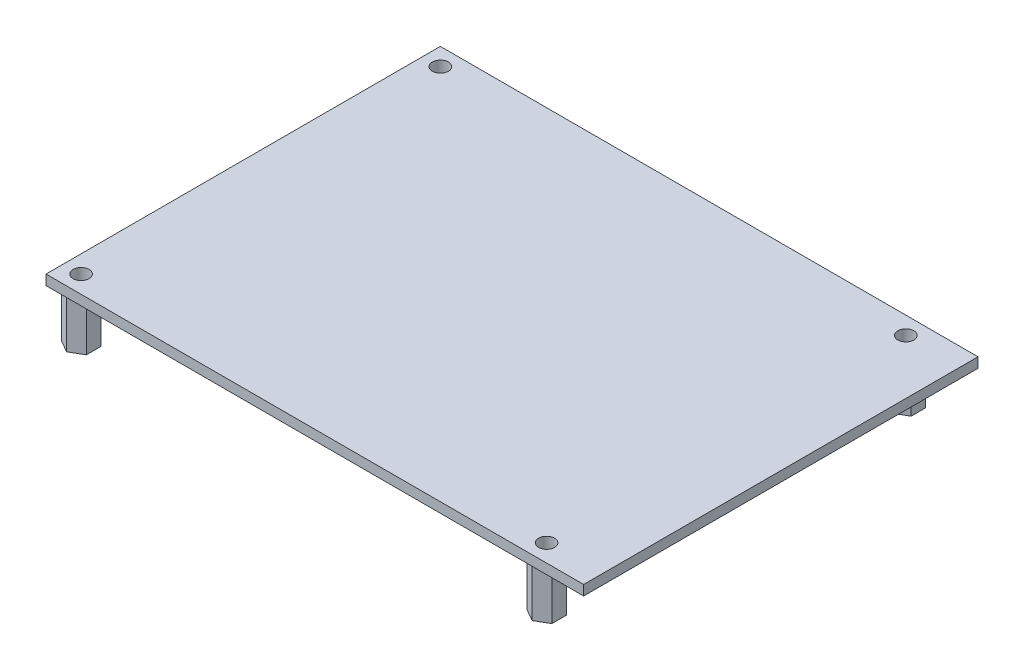
ISO-10303-21;
HEADER;
FILE_DESCRIPTION(('STEP AP214'),'2;1');
FILE_NAME('part.step','',(''),(''),'','','');
FILE_SCHEMA(('AUTOMOTIVE_DESIGN { 1 0 10303 214 1 1 1 1 }'));
ENDSEC;
DATA;
#1=APPLICATION_CONTEXT('core data for automotive mechanical design processes');
#2=APPLICATION_PROTOCOL_DEFINITION('international standard','automotive_design',2000,#1);
#3=PRODUCT_CONTEXT('',#1,'mechanical');
#4=PRODUCT('Part','Part','',(#3));
#5=PRODUCT_RELATED_PRODUCT_CATEGORY('part','',(#4));
#6=PRODUCT_DEFINITION_FORMATION('','',#4);
#7=PRODUCT_DEFINITION_CONTEXT('part definition',#1,'design');
#8=PRODUCT_DEFINITION('design','',#6,#7);
#9=PRODUCT_DEFINITION_SHAPE('','',#8);
#10=(LENGTH_UNIT() NAMED_UNIT(*) SI_UNIT(.MILLI.,.METRE.));
#11=(NAMED_UNIT(*) PLANE_ANGLE_UNIT() SI_UNIT($,.RADIAN.));
#12=(NAMED_UNIT(*) SI_UNIT($,.STERADIAN.) SOLID_ANGLE_UNIT());
#13=UNCERTAINTY_MEASURE_WITH_UNIT(LENGTH_MEASURE(1.E-05),#10,'distance_accuracy_value','');
#14=(GEOMETRIC_REPRESENTATION_CONTEXT(3) GLOBAL_UNCERTAINTY_ASSIGNED_CONTEXT((#13)) GLOBAL_UNIT_ASSIGNED_CONTEXT((#10,
#11,#12)) REPRESENTATION_CONTEXT('',''));
#15=CARTESIAN_POINT('',(0.,0.,0.));
#16=DIRECTION('',(0.,0.,1.));
#17=DIRECTION('',(1.,0.,0.));
#18=AXIS2_PLACEMENT_3D('',#15,#16,#17);
#19=CARTESIAN_POINT('',(0.,0.,0.));
#20=DIRECTION('',(0.,-1.,0.));
#21=DIRECTION('',(0.,0.,-1.));
#22=AXIS2_PLACEMENT_3D('',#19,#20,#21);
#23=PLANE('',#22);
#24=DIRECTION('',(0.866025403784439,0.,0.5));
#25=VECTOR('',#24,1.);
#26=CARTESIAN_POINT('',(3.49999999999999,0.,-6.38675134594813));
#27=LINE('',#26,#25);
#28=CARTESIAN_POINT('',(3.49999999999999,0.,-6.38675134594813));
#29=VERTEX_POINT('',#28);
#30=CARTESIAN_POINT('',(5.99999999999999,0.,-4.94337567297407));
#31=VERTEX_POINT('',#30);
#32=EDGE_CURVE('E246',#29,#31,#27,.T.);
#33=ORIENTED_EDGE('',*,*,#32,.F.);
#34=DIRECTION('',(0.866025403784439,0.,-0.5));
#35=VECTOR('',#34,1.);
#36=CARTESIAN_POINT('',(0.999999999999992,0.,-4.94337567297407));
#37=LINE('',#36,#35);
#38=CARTESIAN_POINT('',(0.999999999999992,0.,-4.94337567297407));
#39=VERTEX_POINT('',#38);
#40=EDGE_CURVE('E243',#39,#29,#37,.T.);
#41=ORIENTED_EDGE('',*,*,#40,.F.);
#42=DIRECTION('',(0.,0.,-1.));
#43=VECTOR('',#42,1.);
#44=CARTESIAN_POINT('',(0.999999999999993,0.,-2.05662432702594));
#45=LINE('',#44,#43);
#46=CARTESIAN_POINT('',(0.999999999999993,0.,-2.05662432702594));
#47=VERTEX_POINT('',#46);
#48=EDGE_CURVE('E256',#47,#39,#45,.T.);
#49=ORIENTED_EDGE('',*,*,#48,.F.);
#50=DIRECTION('',(-0.866025403784439,0.,-0.5));
#51=VECTOR('',#50,1.);
#52=CARTESIAN_POINT('',(3.49999999999999,0.,-0.613248654051876));
#53=LINE('',#52,#51);
#54=CARTESIAN_POINT('',(3.49999999999999,0.,-0.613248654051876));
#55=VERTEX_POINT('',#54);
#56=EDGE_CURVE('E272',#55,#47,#53,.T.);
#57=ORIENTED_EDGE('',*,*,#56,.F.);
#58=DIRECTION('',(-0.866025403784439,0.,0.5));
#59=VECTOR('',#58,1.);
#60=CARTESIAN_POINT('',(5.99999999999999,0.,-2.05662432702594));
#61=LINE('',#60,#59);
#62=CARTESIAN_POINT('',(5.99999999999999,0.,-2.05662432702594));
#63=VERTEX_POINT('',#62);
#64=EDGE_CURVE('E270',#63,#55,#61,.T.);
#65=ORIENTED_EDGE('',*,*,#64,.F.);
#66=DIRECTION('',(0.,0.,1.));
#67=VECTOR('',#66,1.);
#68=CARTESIAN_POINT('',(5.99999999999999,0.,-4.94337567297407));
#69=LINE('',#68,#67);
#70=EDGE_CURVE('E268',#31,#63,#69,.T.);
#71=ORIENTED_EDGE('',*,*,#70,.F.);
#72=EDGE_LOOP('',(#33,#41,#49,#57,#65,#71));
#73=FACE_BOUND('',#72,.T.);
#74=DIRECTION('',(0.866025403784439,0.,-0.5));
#75=VECTOR('',#74,1.);
#76=CARTESIAN_POINT('',(93.9,0.,-4.94337567297404));
#77=LINE('',#76,#75);
#78=CARTESIAN_POINT('',(93.9,0.,-4.94337567297404));
#79=VERTEX_POINT('',#78);
#80=CARTESIAN_POINT('',(96.4,0.,-6.3867513459481));
#81=VERTEX_POINT('',#80);
#82=EDGE_CURVE('E350',#79,#81,#77,.T.);
#83=ORIENTED_EDGE('',*,*,#82,.F.);
#84=DIRECTION('',(0.,0.,-1.));
#85=VECTOR('',#84,1.);
#86=CARTESIAN_POINT('',(93.9,0.,-2.05662432702593));
#87=LINE('',#86,#85);
#88=CARTESIAN_POINT('',(93.9,0.,-2.05662432702593));
#89=VERTEX_POINT('',#88);
#90=EDGE_CURVE('E332',#89,#79,#87,.T.);
#91=ORIENTED_EDGE('',*,*,#90,.F.);
#92=DIRECTION('',(-0.866025403784438,0.,-0.5));
#93=VECTOR('',#92,1.);
#94=CARTESIAN_POINT('',(96.4,0.,-0.613248654051875));
#95=LINE('',#94,#93);
#96=CARTESIAN_POINT('',(96.4,0.,-0.613248654051865));
#97=VERTEX_POINT('',#96);
#98=EDGE_CURVE('E337',#97,#89,#95,.T.);
#99=ORIENTED_EDGE('',*,*,#98,.F.);
#100=DIRECTION('',(-0.866025403784439,0.,0.499999999999999));
#101=VECTOR('',#100,1.);
#102=CARTESIAN_POINT('',(98.9,0.,-2.05662432702594));
#103=LINE('',#102,#101);
#104=CARTESIAN_POINT('',(98.9,0.,-2.05662432702594));
#105=VERTEX_POINT('',#104);
#106=EDGE_CURVE('E356',#105,#97,#103,.T.);
#107=ORIENTED_EDGE('',*,*,#106,.F.);
#108=DIRECTION('',(0.,0.,1.));
#109=VECTOR('',#108,1.);
#110=CARTESIAN_POINT('',(98.9,0.,-4.94337567297405));
#111=LINE('',#110,#109);
#112=CARTESIAN_POINT('',(98.9,0.,-4.94337567297405));
#113=VERTEX_POINT('',#112);
#114=EDGE_CURVE('E354',#113,#105,#111,.T.);
#115=ORIENTED_EDGE('',*,*,#114,.F.);
#116=DIRECTION('',(0.866025403784439,0.,0.5));
#117=VECTOR('',#116,1.);
#118=CARTESIAN_POINT('',(96.4,0.,-6.3867513459481));
#119=LINE('',#118,#117);
#120=EDGE_CURVE('E352',#81,#113,#119,.T.);
#121=ORIENTED_EDGE('',*,*,#120,.F.);
#122=EDGE_LOOP('',(#83,#91,#99,#107,#115,#121));
#123=FACE_BOUND('',#122,.T.);
#124=DIRECTION('',(0.,0.,1.));
#125=VECTOR('',#124,1.);
#126=CARTESIAN_POINT('',(0.,0.,0.));
#127=LINE('',#126,#125);
#128=CARTESIAN_POINT('',(0.,0.,-78.7));
#129=VERTEX_POINT('',#128);
#130=CARTESIAN_POINT('',(0.,0.,0.));
#131=VERTEX_POINT('',#130);
#132=EDGE_CURVE('E387',#129,#131,#127,.T.);
#133=ORIENTED_EDGE('',*,*,#132,.F.);
#134=DIRECTION('',(-1.,0.,0.));
#135=VECTOR('',#134,1.);
#136=CARTESIAN_POINT('',(0.,0.,-78.7));
#137=LINE('',#136,#135);
#138=CARTESIAN_POINT('',(107.3,0.,-78.7));
#139=VERTEX_POINT('',#138);
#140=EDGE_CURVE('E392',#139,#129,#137,.T.);
#141=ORIENTED_EDGE('',*,*,#140,.F.);
#142=DIRECTION('',(0.,0.,-1.));
#143=VECTOR('',#142,1.);
#144=CARTESIAN_POINT('',(107.3,0.,0.));
#145=LINE('',#144,#143);
#146=CARTESIAN_POINT('',(107.3,0.,0.));
#147=VERTEX_POINT('',#146);
#148=EDGE_CURVE('E403',#147,#139,#145,.T.);
#149=ORIENTED_EDGE('',*,*,#148,.F.);
#150=DIRECTION('',(1.,0.,0.));
#151=VECTOR('',#150,1.);
#152=CARTESIAN_POINT('',(0.,0.,0.));
#153=LINE('',#152,#151);
#154=EDGE_CURVE('E401',#131,#147,#153,.T.);
#155=ORIENTED_EDGE('',*,*,#154,.F.);
#156=EDGE_LOOP('',(#133,#141,#149,#155));
#157=FACE_BOUND('',#156,.T.);
#158=DIRECTION('',(0.866025403784439,0.,-0.499999999999999));
#159=VECTOR('',#158,1.);
#160=CARTESIAN_POINT('',(93.9,0.,-76.6433756729741));
#161=LINE('',#160,#159);
#162=CARTESIAN_POINT('',(93.9,0.,-76.6433756729741));
#163=VERTEX_POINT('',#162);
#164=CARTESIAN_POINT('',(96.4,0.,-78.0867513459481));
#165=VERTEX_POINT('',#164);
#166=EDGE_CURVE('E307',#163,#165,#161,.T.);
#167=ORIENTED_EDGE('',*,*,#166,.F.);
#168=DIRECTION('',(0.,0.,-1.));
#169=VECTOR('',#168,1.);
#170=CARTESIAN_POINT('',(93.9,0.,-73.756624327026));
#171=LINE('',#170,#169);
#172=CARTESIAN_POINT('',(93.9,0.,-73.756624327026));
#173=VERTEX_POINT('',#172);
#174=EDGE_CURVE('E289',#173,#163,#171,.T.);
#175=ORIENTED_EDGE('',*,*,#174,.F.);
#176=DIRECTION('',(-0.866025403784437,0.,-0.500000000000003));
#177=VECTOR('',#176,1.);
#178=CARTESIAN_POINT('',(96.4,0.,-72.3132486540519));
#179=LINE('',#178,#177);
#180=CARTESIAN_POINT('',(96.4,0.,-72.3132486540519));
#181=VERTEX_POINT('',#180);
#182=EDGE_CURVE('E294',#181,#173,#179,.T.);
#183=ORIENTED_EDGE('',*,*,#182,.F.);
#184=DIRECTION('',(-0.866025403784441,0.,0.499999999999995));
#185=VECTOR('',#184,1.);
#186=CARTESIAN_POINT('',(98.9,0.,-73.7566243270259));
#187=LINE('',#186,#185);
#188=CARTESIAN_POINT('',(98.9,0.,-73.7566243270259));
#189=VERTEX_POINT('',#188);
#190=EDGE_CURVE('E313',#189,#181,#187,.T.);
#191=ORIENTED_EDGE('',*,*,#190,.F.);
#192=DIRECTION('',(0.,0.,1.));
#193=VECTOR('',#192,1.);
#194=CARTESIAN_POINT('',(98.9,0.,-76.6433756729741));
#195=LINE('',#194,#193);
#196=CARTESIAN_POINT('',(98.9,0.,-76.6433756729741));
#197=VERTEX_POINT('',#196);
#198=EDGE_CURVE('E311',#197,#189,#195,.T.);
#199=ORIENTED_EDGE('',*,*,#198,.F.);
#200=DIRECTION('',(0.866025403784441,0.,0.499999999999995));
#201=VECTOR('',#200,1.);
#202=CARTESIAN_POINT('',(96.4,0.,-78.0867513459481));
#203=LINE('',#202,#201);
#204=EDGE_CURVE('E309',#165,#197,#203,.T.);
#205=ORIENTED_EDGE('',*,*,#204,.F.);
#206=EDGE_LOOP('',(#167,#175,#183,#191,#199,#205));
#207=FACE_BOUND('',#206,.T.);
#208=DIRECTION('',(-0.866025403784438,0.,-0.500000000000001));
#209=VECTOR('',#208,1.);
#210=CARTESIAN_POINT('',(3.49999999999999,0.,-72.3132486540519));
#211=LINE('',#210,#209);
#212=CARTESIAN_POINT('',(3.49999999999999,0.,-72.3132486540519));
#213=VERTEX_POINT('',#212);
#214=CARTESIAN_POINT('',(0.999999999999984,0.,-73.7566243270259));
#215=VERTEX_POINT('',#214);
#216=EDGE_CURVE('E599',#213,#215,#211,.T.);
#217=ORIENTED_EDGE('',*,*,#216,.F.);
#218=DIRECTION('',(-0.866025403784438,0.,0.500000000000001));
#219=VECTOR('',#218,1.);
#220=CARTESIAN_POINT('',(5.99999999999998,0.,-73.7566243270259));
#221=LINE('',#220,#219);
#222=CARTESIAN_POINT('',(5.99999999999998,0.,-73.7566243270259));
#223=VERTEX_POINT('',#222);
#224=EDGE_CURVE('E241',#223,#213,#221,.T.);
#225=ORIENTED_EDGE('',*,*,#224,.F.);
#226=DIRECTION('',(0.,0.,1.));
#227=VECTOR('',#226,1.);
#228=CARTESIAN_POINT('',(5.99999999999998,0.,-76.6433756729741));
#229=LINE('',#228,#227);
#230=CARTESIAN_POINT('',(5.99999999999998,0.,-76.6433756729741));
#231=VERTEX_POINT('',#230);
#232=EDGE_CURVE('E237',#231,#223,#229,.T.);
#233=ORIENTED_EDGE('',*,*,#232,.F.);
#234=DIRECTION('',(0.866025403784438,0.,0.500000000000001));
#235=VECTOR('',#234,1.);
#236=CARTESIAN_POINT('',(3.49999999999999,0.,-78.0867513459481));
#237=LINE('',#236,#235);
#238=CARTESIAN_POINT('',(3.49999999999999,0.,-78.0867513459481));
#239=VERTEX_POINT('',#238);
#240=EDGE_CURVE('E605',#239,#231,#237,.T.);
#241=ORIENTED_EDGE('',*,*,#240,.F.);
#242=DIRECTION('',(0.86602540378444,0.,-0.499999999999998));
#243=VECTOR('',#242,1.);
#244=CARTESIAN_POINT('',(0.999999999999985,0.,-76.6433756729741));
#245=LINE('',#244,#243);
#246=CARTESIAN_POINT('',(0.999999999999985,0.,-76.6433756729741));
#247=VERTEX_POINT('',#246);
#248=EDGE_CURVE('E603',#247,#239,#245,.T.);
#249=ORIENTED_EDGE('',*,*,#248,.F.);
#250=DIRECTION('',(0.,0.,-1.));
#251=VECTOR('',#250,1.);
#252=CARTESIAN_POINT('',(0.999999999999984,0.,-73.7566243270259));
#253=LINE('',#252,#251);
#254=EDGE_CURVE('E601',#215,#247,#253,.T.);
#255=ORIENTED_EDGE('',*,*,#254,.F.);
#256=EDGE_LOOP('',(#217,#225,#233,#241,#249,#255));
#257=FACE_BOUND('',#256,.T.);
#258=ADVANCED_FACE('F32',(#73,#123,#157,#207,#257),#23,.T.);
#259=CARTESIAN_POINT('',(0.,2.,0.));
#260=DIRECTION('',(0.,-1.,0.));
#261=DIRECTION('',(0.,0.,-1.));
#262=AXIS2_PLACEMENT_3D('',#259,#260,#261);
#263=PLANE('',#262);
#264=DIRECTION('',(0.,0.,1.));
#265=VECTOR('',#264,1.);
#266=CARTESIAN_POINT('',(0.,2.,0.));
#267=LINE('',#266,#265);
#268=CARTESIAN_POINT('',(0.,2.,-78.7));
#269=VERTEX_POINT('',#268);
#270=CARTESIAN_POINT('',(0.,2.,0.));
#271=VERTEX_POINT('',#270);
#272=EDGE_CURVE('E388',#269,#271,#267,.T.);
#273=ORIENTED_EDGE('',*,*,#272,.T.);
#274=DIRECTION('',(1.,0.,0.));
#275=VECTOR('',#274,1.);
#276=CARTESIAN_POINT('',(0.,2.,0.));
#277=LINE('',#276,#275);
#278=CARTESIAN_POINT('',(107.3,2.,0.));
#279=VERTEX_POINT('',#278);
#280=EDGE_CURVE('E391',#271,#279,#277,.T.);
#281=ORIENTED_EDGE('',*,*,#280,.T.);
#282=DIRECTION('',(0.,0.,-1.));
#283=VECTOR('',#282,1.);
#284=CARTESIAN_POINT('',(107.3,2.,0.));
#285=LINE('',#284,#283);
#286=CARTESIAN_POINT('',(107.3,2.,-78.7));
#287=VERTEX_POINT('',#286);
#288=EDGE_CURVE('E394',#279,#287,#285,.T.);
#289=ORIENTED_EDGE('',*,*,#288,.T.);
#290=DIRECTION('',(-1.,0.,0.));
#291=VECTOR('',#290,1.);
#292=CARTESIAN_POINT('',(0.,2.,-78.7));
#293=LINE('',#292,#291);
#294=EDGE_CURVE('E396',#287,#269,#293,.T.);
#295=ORIENTED_EDGE('',*,*,#294,.T.);
#296=EDGE_LOOP('',(#273,#281,#289,#295));
#297=FACE_BOUND('',#296,.T.);
#298=CARTESIAN_POINT('',(3.49999999999999,2.,-75.2));
#299=DIRECTION('',(0.,1.,0.));
#300=DIRECTION('',(0.,0.,1.));
#301=AXIS2_PLACEMENT_3D('',#298,#299,#300);
#302=CIRCLE('',#301,1.6);
#303=CARTESIAN_POINT('',(3.49999999999999,2.,-73.6));
#304=VERTEX_POINT('',#303);
#305=EDGE_CURVE('E384',#304,#304,#302,.T.);
#306=ORIENTED_EDGE('',*,*,#305,.F.);
#307=EDGE_LOOP('',(#306));
#308=FACE_BOUND('',#307,.T.);
#309=CARTESIAN_POINT('',(96.4,2.,-75.2));
#310=DIRECTION('',(0.,1.,0.));
#311=DIRECTION('',(0.,0.,1.));
#312=AXIS2_PLACEMENT_3D('',#309,#310,#311);
#313=CIRCLE('',#312,1.60000000000001);
#314=CARTESIAN_POINT('',(96.4,2.,-73.6));
#315=VERTEX_POINT('',#314);
#316=EDGE_CURVE('E381',#315,#315,#313,.T.);
#317=ORIENTED_EDGE('',*,*,#316,.F.);
#318=EDGE_LOOP('',(#317));
#319=FACE_BOUND('',#318,.T.);
#320=CARTESIAN_POINT('',(96.4,2.,-3.5));
#321=DIRECTION('',(0.,1.,0.));
#322=DIRECTION('',(0.,0.,1.));
#323=AXIS2_PLACEMENT_3D('',#320,#321,#322);
#324=CIRCLE('',#323,1.60000000000001);
#325=CARTESIAN_POINT('',(96.4,2.,-1.9));
#326=VERTEX_POINT('',#325);
#327=EDGE_CURVE('E378',#326,#326,#324,.T.);
#328=ORIENTED_EDGE('',*,*,#327,.F.);
#329=EDGE_LOOP('',(#328));
#330=FACE_BOUND('',#329,.T.);
#331=CARTESIAN_POINT('',(3.49999999999999,2.,-3.5));
#332=DIRECTION('',(0.,1.,0.));
#333=DIRECTION('',(0.,0.,1.));
#334=AXIS2_PLACEMENT_3D('',#331,#332,#333);
#335=CIRCLE('',#334,1.6);
#336=CARTESIAN_POINT('',(3.49999999999999,2.,-1.9));
#337=VERTEX_POINT('',#336);
#338=EDGE_CURVE('E375',#337,#337,#335,.T.);
#339=ORIENTED_EDGE('',*,*,#338,.F.);
#340=EDGE_LOOP('',(#339));
#341=FACE_BOUND('',#340,.T.);
#342=ADVANCED_FACE('F430',(#297,#308,#319,#330,#341),#263,.F.);
#343=CARTESIAN_POINT('',(0.,2.,0.));
#344=DIRECTION('',(1.,0.,0.));
#345=DIRECTION('',(0.,0.,-1.));
#346=AXIS2_PLACEMENT_3D('',#343,#344,#345);
#347=PLANE('',#346);
#348=ORIENTED_EDGE('',*,*,#132,.T.);
#349=DIRECTION('',(0.,-1.,0.));
#350=VECTOR('',#349,1.);
#351=CARTESIAN_POINT('',(0.,2.,0.));
#352=LINE('',#351,#350);
#353=EDGE_CURVE('E11',#271,#131,#352,.T.);
#354=ORIENTED_EDGE('',*,*,#353,.F.);
#355=ORIENTED_EDGE('',*,*,#272,.F.);
#356=DIRECTION('',(0.,-1.,0.));
#357=VECTOR('',#356,1.);
#358=CARTESIAN_POINT('',(0.,2.,-78.7));
#359=LINE('',#358,#357);
#360=EDGE_CURVE('E398',#269,#129,#359,.T.);
#361=ORIENTED_EDGE('',*,*,#360,.T.);
#362=EDGE_LOOP('',(#348,#354,#355,#361));
#363=FACE_BOUND('',#362,.T.);
#364=ADVANCED_FACE('F34',(#363),#347,.F.);
#365=CARTESIAN_POINT('',(0.,2.,0.));
#366=DIRECTION('',(0.,0.,-1.));
#367=DIRECTION('',(-1.,0.,0.));
#368=AXIS2_PLACEMENT_3D('',#365,#366,#367);
#369=PLANE('',#368);
#370=ORIENTED_EDGE('',*,*,#154,.T.);
#371=DIRECTION('',(0.,-1.,0.));
#372=VECTOR('',#371,1.);
#373=CARTESIAN_POINT('',(107.3,2.,0.));
#374=LINE('',#373,#372);
#375=EDGE_CURVE('E40',#279,#147,#374,.T.);
#376=ORIENTED_EDGE('',*,*,#375,.F.);
#377=ORIENTED_EDGE('',*,*,#280,.F.);
#378=ORIENTED_EDGE('',*,*,#353,.T.);
#379=EDGE_LOOP('',(#370,#376,#377,#378));
#380=FACE_BOUND('',#379,.T.);
#381=ADVANCED_FACE('F432',(#380),#369,.F.);
#382=CARTESIAN_POINT('',(107.3,2.,0.));
#383=DIRECTION('',(-1.,0.,0.));
#384=DIRECTION('',(0.,0.,1.));
#385=AXIS2_PLACEMENT_3D('',#382,#383,#384);
#386=PLANE('',#385);
#387=ORIENTED_EDGE('',*,*,#148,.T.);
#388=DIRECTION('',(0.,-1.,0.));
#389=VECTOR('',#388,1.);
#390=CARTESIAN_POINT('',(107.3,2.,-78.7));
#391=LINE('',#390,#389);
#392=EDGE_CURVE('E408',#287,#139,#391,.T.);
#393=ORIENTED_EDGE('',*,*,#392,.F.);
#394=ORIENTED_EDGE('',*,*,#288,.F.);
#395=ORIENTED_EDGE('',*,*,#375,.T.);
#396=EDGE_LOOP('',(#387,#393,#394,#395));
#397=FACE_BOUND('',#396,.T.);
#398=ADVANCED_FACE('F415',(#397),#386,.F.);
#399=CARTESIAN_POINT('',(0.,2.,-78.7));
#400=DIRECTION('',(0.,0.,1.));
#401=DIRECTION('',(1.,0.,0.));
#402=AXIS2_PLACEMENT_3D('',#399,#400,#401);
#403=PLANE('',#402);
#404=ORIENTED_EDGE('',*,*,#140,.T.);
#405=ORIENTED_EDGE('',*,*,#360,.F.);
#406=ORIENTED_EDGE('',*,*,#294,.F.);
#407=ORIENTED_EDGE('',*,*,#392,.T.);
#408=EDGE_LOOP('',(#404,#405,#406,#407));
#409=FACE_BOUND('',#408,.T.);
#410=ADVANCED_FACE('F424',(#409),#403,.F.);
#411=CARTESIAN_POINT('',(3.49999999999999,2.,-75.2));
#412=DIRECTION('',(0.,-1.,0.));
#413=DIRECTION('',(0.,0.,-1.));
#414=AXIS2_PLACEMENT_3D('',#411,#412,#413);
#415=CYLINDRICAL_SURFACE('',#414,1.6);
#416=ORIENTED_EDGE('',*,*,#305,.T.);
#417=EDGE_LOOP('',(#416));
#418=FACE_BOUND('',#417,.T.);
#419=CARTESIAN_POINT('',(3.49999999999999,-10.,-75.2));
#420=DIRECTION('',(0.,1.,0.));
#421=DIRECTION('',(0.,0.,1.));
#422=AXIS2_PLACEMENT_3D('',#419,#420,#421);
#423=CIRCLE('',#422,1.60000000000001);
#424=CARTESIAN_POINT('',(3.49999999999999,-10.,-73.6));
#425=VERTEX_POINT('',#424);
#426=EDGE_CURVE('E580',#425,#425,#423,.T.);
#427=ORIENTED_EDGE('',*,*,#426,.F.);
#428=EDGE_LOOP('',(#427));
#429=FACE_BOUND('',#428,.T.);
#430=ADVANCED_FACE('F451',(#418,#429),#415,.F.);
#431=CARTESIAN_POINT('',(96.4,2.,-75.2));
#432=DIRECTION('',(0.,-1.,0.));
#433=DIRECTION('',(0.,0.,-1.));
#434=AXIS2_PLACEMENT_3D('',#431,#432,#433);
#435=CYLINDRICAL_SURFACE('',#434,1.60000000000001);
#436=ORIENTED_EDGE('',*,*,#316,.T.);
#437=EDGE_LOOP('',(#436));
#438=FACE_BOUND('',#437,.T.);
#439=CARTESIAN_POINT('',(96.4,-10.,-75.2));
#440=DIRECTION('',(0.,1.,0.));
#441=DIRECTION('',(0.,0.,1.));
#442=AXIS2_PLACEMENT_3D('',#439,#440,#441);
#443=CIRCLE('',#442,1.60000000000001);
#444=CARTESIAN_POINT('',(96.4,-10.,-73.6));
#445=VERTEX_POINT('',#444);
#446=EDGE_CURVE('E582',#445,#445,#443,.T.);
#447=ORIENTED_EDGE('',*,*,#446,.F.);
#448=EDGE_LOOP('',(#447));
#449=FACE_BOUND('',#448,.T.);
#450=ADVANCED_FACE('F455',(#438,#449),#435,.F.);
#451=CARTESIAN_POINT('',(96.4,2.,-3.5));
#452=DIRECTION('',(0.,-1.,0.));
#453=DIRECTION('',(0.,0.,-1.));
#454=AXIS2_PLACEMENT_3D('',#451,#452,#453);
#455=CYLINDRICAL_SURFACE('',#454,1.60000000000001);
#456=ORIENTED_EDGE('',*,*,#327,.T.);
#457=EDGE_LOOP('',(#456));
#458=FACE_BOUND('',#457,.T.);
#459=CARTESIAN_POINT('',(96.4,-10.,-3.5));
#460=DIRECTION('',(0.,1.,0.));
#461=DIRECTION('',(0.,0.,1.));
#462=AXIS2_PLACEMENT_3D('',#459,#460,#461);
#463=CIRCLE('',#462,1.60000000000001);
#464=CARTESIAN_POINT('',(96.4,-10.,-1.9));
#465=VERTEX_POINT('',#464);
#466=EDGE_CURVE('E587',#465,#465,#463,.T.);
#467=ORIENTED_EDGE('',*,*,#466,.F.);
#468=EDGE_LOOP('',(#467));
#469=FACE_BOUND('',#468,.T.);
#470=ADVANCED_FACE('F460',(#458,#469),#455,.F.);
#471=CARTESIAN_POINT('',(3.49999999999999,2.,-3.5));
#472=DIRECTION('',(0.,-1.,0.));
#473=DIRECTION('',(0.,0.,-1.));
#474=AXIS2_PLACEMENT_3D('',#471,#472,#473);
#475=CYLINDRICAL_SURFACE('',#474,1.6);
#476=ORIENTED_EDGE('',*,*,#338,.T.);
#477=EDGE_LOOP('',(#476));
#478=FACE_BOUND('',#477,.T.);
#479=CARTESIAN_POINT('',(3.49999999999999,-10.,-3.5));
#480=DIRECTION('',(0.,1.,0.));
#481=DIRECTION('',(0.,0.,1.));
#482=AXIS2_PLACEMENT_3D('',#479,#480,#481);
#483=CIRCLE('',#482,1.6);
#484=CARTESIAN_POINT('',(3.49999999999999,-10.,-1.9));
#485=VERTEX_POINT('',#484);
#486=EDGE_CURVE('E581',#485,#485,#483,.T.);
#487=ORIENTED_EDGE('',*,*,#486,.F.);
#488=EDGE_LOOP('',(#487));
#489=FACE_BOUND('',#488,.T.);
#490=ADVANCED_FACE('F467',(#478,#489),#475,.F.);
#491=CARTESIAN_POINT('',(93.9,-10.,-2.05662432702593));
#492=DIRECTION('',(1.,0.,0.));
#493=DIRECTION('',(0.,0.,-1.));
#494=AXIS2_PLACEMENT_3D('',#491,#492,#493);
#495=PLANE('',#494);
#496=ORIENTED_EDGE('',*,*,#90,.T.);
#497=DIRECTION('',(0.,1.,0.));
#498=VECTOR('',#497,1.);
#499=CARTESIAN_POINT('',(93.9,-10.,-4.94337567297404));
#500=LINE('',#499,#498);
#501=CARTESIAN_POINT('',(93.9,-10.,-4.94337567297404));
#502=VERTEX_POINT('',#501);
#503=EDGE_CURVE('E373',#502,#79,#500,.T.);
#504=ORIENTED_EDGE('',*,*,#503,.F.);
#505=DIRECTION('',(0.,0.,-1.));
#506=VECTOR('',#505,1.);
#507=CARTESIAN_POINT('',(93.9,-10.,-2.05662432702593));
#508=LINE('',#507,#506);
#509=CARTESIAN_POINT('',(93.9,-10.,-2.05662432702593));
#510=VERTEX_POINT('',#509);
#511=EDGE_CURVE('E333',#510,#502,#508,.T.);
#512=ORIENTED_EDGE('',*,*,#511,.F.);
#513=DIRECTION('',(0.,1.,0.));
#514=VECTOR('',#513,1.);
#515=CARTESIAN_POINT('',(93.9,-10.,-2.05662432702593));
#516=LINE('',#515,#514);
#517=EDGE_CURVE('E347',#510,#89,#516,.T.);
#518=ORIENTED_EDGE('',*,*,#517,.T.);
#519=EDGE_LOOP('',(#496,#504,#512,#518));
#520=FACE_BOUND('',#519,.T.);
#521=ADVANCED_FACE('F471',(#520),#495,.F.);
#522=CARTESIAN_POINT('',(93.9,-10.,-4.94337567297404));
#523=DIRECTION('',(0.5,0.,0.866025403784439));
#524=DIRECTION('',(0.866025403784439,0.,-0.5));
#525=AXIS2_PLACEMENT_3D('',#522,#523,#524);
#526=PLANE('',#525);
#527=ORIENTED_EDGE('',*,*,#82,.T.);
#528=DIRECTION('',(0.,1.,0.));
#529=VECTOR('',#528,1.);
#530=CARTESIAN_POINT('',(96.4,-10.,-6.3867513459481));
#531=LINE('',#530,#529);
#532=CARTESIAN_POINT('',(96.4,-10.,-6.3867513459481));
#533=VERTEX_POINT('',#532);
#534=EDGE_CURVE('E370',#533,#81,#531,.T.);
#535=ORIENTED_EDGE('',*,*,#534,.F.);
#536=DIRECTION('',(0.866025403784439,0.,-0.5));
#537=VECTOR('',#536,1.);
#538=CARTESIAN_POINT('',(93.9,-10.,-4.94337567297404));
#539=LINE('',#538,#537);
#540=EDGE_CURVE('E336',#502,#533,#539,.T.);
#541=ORIENTED_EDGE('',*,*,#540,.F.);
#542=ORIENTED_EDGE('',*,*,#503,.T.);
#543=EDGE_LOOP('',(#527,#535,#541,#542));
#544=FACE_BOUND('',#543,.T.);
#545=ADVANCED_FACE('F475',(#544),#526,.F.);
#546=CARTESIAN_POINT('',(96.4,-10.,-6.3867513459481));
#547=DIRECTION('',(-0.5,0.,0.866025403784439));
#548=DIRECTION('',(0.866025403784439,0.,0.5));
#549=AXIS2_PLACEMENT_3D('',#546,#547,#548);
#550=PLANE('',#549);
#551=ORIENTED_EDGE('',*,*,#120,.T.);
#552=DIRECTION('',(0.,1.,0.));
#553=VECTOR('',#552,1.);
#554=CARTESIAN_POINT('',(98.9,-10.,-4.94337567297405));
#555=LINE('',#554,#553);
#556=CARTESIAN_POINT('',(98.9,-10.,-4.94337567297405));
#557=VERTEX_POINT('',#556);
#558=EDGE_CURVE('E367',#557,#113,#555,.T.);
#559=ORIENTED_EDGE('',*,*,#558,.F.);
#560=DIRECTION('',(0.866025403784439,0.,0.5));
#561=VECTOR('',#560,1.);
#562=CARTESIAN_POINT('',(96.4,-10.,-6.3867513459481));
#563=LINE('',#562,#561);
#564=EDGE_CURVE('E339',#533,#557,#563,.T.);
#565=ORIENTED_EDGE('',*,*,#564,.F.);
#566=ORIENTED_EDGE('',*,*,#534,.T.);
#567=EDGE_LOOP('',(#551,#559,#565,#566));
#568=FACE_BOUND('',#567,.T.);
#569=ADVANCED_FACE('F479',(#568),#550,.F.);
#570=CARTESIAN_POINT('',(98.9,-10.,-4.94337567297405));
#571=DIRECTION('',(-1.,0.,0.));
#572=DIRECTION('',(0.,0.,1.));
#573=AXIS2_PLACEMENT_3D('',#570,#571,#572);
#574=PLANE('',#573);
#575=ORIENTED_EDGE('',*,*,#114,.T.);
#576=DIRECTION('',(0.,1.,0.));
#577=VECTOR('',#576,1.);
#578=CARTESIAN_POINT('',(98.9,-10.,-2.05662432702594));
#579=LINE('',#578,#577);
#580=CARTESIAN_POINT('',(98.9,-10.,-2.05662432702594));
#581=VERTEX_POINT('',#580);
#582=EDGE_CURVE('E364',#581,#105,#579,.T.);
#583=ORIENTED_EDGE('',*,*,#582,.F.);
#584=DIRECTION('',(0.,0.,1.));
#585=VECTOR('',#584,1.);
#586=CARTESIAN_POINT('',(98.9,-10.,-4.94337567297405));
#587=LINE('',#586,#585);
#588=EDGE_CURVE('E341',#557,#581,#587,.T.);
#589=ORIENTED_EDGE('',*,*,#588,.F.);
#590=ORIENTED_EDGE('',*,*,#558,.T.);
#591=EDGE_LOOP('',(#575,#583,#589,#590));
#592=FACE_BOUND('',#591,.T.);
#593=ADVANCED_FACE('F483',(#592),#574,.F.);
#594=CARTESIAN_POINT('',(98.9,-10.,-2.05662432702594));
#595=DIRECTION('',(-0.5,0.,-0.866025403784439));
#596=DIRECTION('',(-0.866025403784439,0.,0.5));
#597=AXIS2_PLACEMENT_3D('',#594,#595,#596);
#598=PLANE('',#597);
#599=ORIENTED_EDGE('',*,*,#106,.T.);
#600=DIRECTION('',(0.,1.,0.));
#601=VECTOR('',#600,1.);
#602=CARTESIAN_POINT('',(96.4,-10.,-0.613248654051875));
#603=LINE('',#602,#601);
#604=CARTESIAN_POINT('',(96.4,-10.,-0.613248654051875));
#605=VERTEX_POINT('',#604);
#606=EDGE_CURVE('E362',#605,#97,#603,.T.);
#607=ORIENTED_EDGE('',*,*,#606,.F.);
#608=DIRECTION('',(-0.866025403784439,0.,0.499999999999999));
#609=VECTOR('',#608,1.);
#610=CARTESIAN_POINT('',(98.9,-10.,-2.05662432702594));
#611=LINE('',#610,#609);
#612=EDGE_CURVE('E343',#581,#605,#611,.T.);
#613=ORIENTED_EDGE('',*,*,#612,.F.);
#614=ORIENTED_EDGE('',*,*,#582,.T.);
#615=EDGE_LOOP('',(#599,#607,#613,#614));
#616=FACE_BOUND('',#615,.T.);
#617=ADVANCED_FACE('F487',(#616),#598,.F.);
#618=CARTESIAN_POINT('',(96.4,-10.,-0.613248654051875));
#619=DIRECTION('',(0.5,0.,-0.866025403784438));
#620=DIRECTION('',(-0.866025403784439,0.,-0.5));
#621=AXIS2_PLACEMENT_3D('',#618,#619,#620);
#622=PLANE('',#621);
#623=ORIENTED_EDGE('',*,*,#98,.T.);
#624=ORIENTED_EDGE('',*,*,#517,.F.);
#625=DIRECTION('',(-0.866025403784438,0.,-0.5));
#626=VECTOR('',#625,1.);
#627=CARTESIAN_POINT('',(96.4,-10.,-0.613248654051875));
#628=LINE('',#627,#626);
#629=EDGE_CURVE('E345',#605,#510,#628,.T.);
#630=ORIENTED_EDGE('',*,*,#629,.F.);
#631=ORIENTED_EDGE('',*,*,#606,.T.);
#632=EDGE_LOOP('',(#623,#624,#630,#631));
#633=FACE_BOUND('',#632,.T.);
#634=ADVANCED_FACE('F491',(#633),#622,.F.);
#635=CARTESIAN_POINT('',(0.,-10.,0.));
#636=DIRECTION('',(0.,-1.,0.));
#637=DIRECTION('',(0.,0.,-1.));
#638=AXIS2_PLACEMENT_3D('',#635,#636,#637);
#639=PLANE('',#638);
#640=ORIENTED_EDGE('',*,*,#466,.T.);
#641=EDGE_LOOP('',(#640));
#642=FACE_BOUND('',#641,.T.);
#643=ORIENTED_EDGE('',*,*,#511,.T.);
#644=ORIENTED_EDGE('',*,*,#540,.T.);
#645=ORIENTED_EDGE('',*,*,#564,.T.);
#646=ORIENTED_EDGE('',*,*,#588,.T.);
#647=ORIENTED_EDGE('',*,*,#612,.T.);
#648=ORIENTED_EDGE('',*,*,#629,.T.);
#649=EDGE_LOOP('',(#643,#644,#645,#646,#647,#648));
#650=FACE_BOUND('',#649,.T.);
#651=ADVANCED_FACE('F495',(#642,#650),#639,.T.);
#652=CARTESIAN_POINT('',(93.9,-10.,-73.756624327026));
#653=DIRECTION('',(1.,0.,0.));
#654=DIRECTION('',(0.,0.,-1.));
#655=AXIS2_PLACEMENT_3D('',#652,#653,#654);
#656=PLANE('',#655);
#657=ORIENTED_EDGE('',*,*,#174,.T.);
#658=DIRECTION('',(0.,1.,0.));
#659=VECTOR('',#658,1.);
#660=CARTESIAN_POINT('',(93.9,-10.,-76.6433756729741));
#661=LINE('',#660,#659);
#662=CARTESIAN_POINT('',(93.9,-10.,-76.6433756729741));
#663=VERTEX_POINT('',#662);
#664=EDGE_CURVE('E330',#663,#163,#661,.T.);
#665=ORIENTED_EDGE('',*,*,#664,.F.);
#666=DIRECTION('',(0.,0.,-1.));
#667=VECTOR('',#666,1.);
#668=CARTESIAN_POINT('',(93.9,-10.,-73.756624327026));
#669=LINE('',#668,#667);
#670=CARTESIAN_POINT('',(93.9,-10.,-73.756624327026));
#671=VERTEX_POINT('',#670);
#672=EDGE_CURVE('E290',#671,#663,#669,.T.);
#673=ORIENTED_EDGE('',*,*,#672,.F.);
#674=DIRECTION('',(0.,1.,0.));
#675=VECTOR('',#674,1.);
#676=CARTESIAN_POINT('',(93.9,-10.,-73.756624327026));
#677=LINE('',#676,#675);
#678=EDGE_CURVE('E304',#671,#173,#677,.T.);
#679=ORIENTED_EDGE('',*,*,#678,.T.);
#680=EDGE_LOOP('',(#657,#665,#673,#679));
#681=FACE_BOUND('',#680,.T.);
#682=ADVANCED_FACE('F499',(#681),#656,.F.);
#683=CARTESIAN_POINT('',(93.9,-10.,-76.6433756729741));
#684=DIRECTION('',(0.499999999999999,0.,0.866025403784439));
#685=DIRECTION('',(0.866025403784439,0.,-0.499999999999999));
#686=AXIS2_PLACEMENT_3D('',#683,#684,#685);
#687=PLANE('',#686);
#688=ORIENTED_EDGE('',*,*,#166,.T.);
#689=DIRECTION('',(0.,1.,0.));
#690=VECTOR('',#689,1.);
#691=CARTESIAN_POINT('',(96.4,-10.,-78.0867513459481));
#692=LINE('',#691,#690);
#693=CARTESIAN_POINT('',(96.4,-10.,-78.0867513459481));
#694=VERTEX_POINT('',#693);
#695=EDGE_CURVE('E327',#694,#165,#692,.T.);
#696=ORIENTED_EDGE('',*,*,#695,.F.);
#697=DIRECTION('',(0.866025403784439,0.,-0.499999999999999));
#698=VECTOR('',#697,1.);
#699=CARTESIAN_POINT('',(93.9,-10.,-76.6433756729741));
#700=LINE('',#699,#698);
#701=EDGE_CURVE('E293',#663,#694,#700,.T.);
#702=ORIENTED_EDGE('',*,*,#701,.F.);
#703=ORIENTED_EDGE('',*,*,#664,.T.);
#704=EDGE_LOOP('',(#688,#696,#702,#703));
#705=FACE_BOUND('',#704,.T.);
#706=ADVANCED_FACE('F503',(#705),#687,.F.);
#707=CARTESIAN_POINT('',(96.4,-10.,-78.0867513459481));
#708=DIRECTION('',(-0.499999999999996,0.,0.866025403784441));
#709=DIRECTION('',(0.866025403784441,0.,0.499999999999996));
#710=AXIS2_PLACEMENT_3D('',#707,#708,#709);
#711=PLANE('',#710);
#712=ORIENTED_EDGE('',*,*,#204,.T.);
#713=DIRECTION('',(0.,1.,0.));
#714=VECTOR('',#713,1.);
#715=CARTESIAN_POINT('',(98.9,-10.,-76.6433756729741));
#716=LINE('',#715,#714);
#717=CARTESIAN_POINT('',(98.9,-10.,-76.6433756729741));
#718=VERTEX_POINT('',#717);
#719=EDGE_CURVE('E324',#718,#197,#716,.T.);
#720=ORIENTED_EDGE('',*,*,#719,.F.);
#721=DIRECTION('',(0.866025403784441,0.,0.499999999999995));
#722=VECTOR('',#721,1.);
#723=CARTESIAN_POINT('',(96.4,-10.,-78.0867513459481));
#724=LINE('',#723,#722);
#725=EDGE_CURVE('E296',#694,#718,#724,.T.);
#726=ORIENTED_EDGE('',*,*,#725,.F.);
#727=ORIENTED_EDGE('',*,*,#695,.T.);
#728=EDGE_LOOP('',(#712,#720,#726,#727));
#729=FACE_BOUND('',#728,.T.);
#730=ADVANCED_FACE('F507',(#729),#711,.F.);
#731=CARTESIAN_POINT('',(98.9,-10.,-76.6433756729741));
#732=DIRECTION('',(-1.,0.,0.));
#733=DIRECTION('',(0.,0.,1.));
#734=AXIS2_PLACEMENT_3D('',#731,#732,#733);
#735=PLANE('',#734);
#736=ORIENTED_EDGE('',*,*,#198,.T.);
#737=DIRECTION('',(0.,1.,0.));
#738=VECTOR('',#737,1.);
#739=CARTESIAN_POINT('',(98.9,-10.,-73.7566243270259));
#740=LINE('',#739,#738);
#741=CARTESIAN_POINT('',(98.9,-10.,-73.7566243270259));
#742=VERTEX_POINT('',#741);
#743=EDGE_CURVE('E321',#742,#189,#740,.T.);
#744=ORIENTED_EDGE('',*,*,#743,.F.);
#745=DIRECTION('',(0.,0.,1.));
#746=VECTOR('',#745,1.);
#747=CARTESIAN_POINT('',(98.9,-10.,-76.6433756729741));
#748=LINE('',#747,#746);
#749=EDGE_CURVE('E298',#718,#742,#748,.T.);
#750=ORIENTED_EDGE('',*,*,#749,.F.);
#751=ORIENTED_EDGE('',*,*,#719,.T.);
#752=EDGE_LOOP('',(#736,#744,#750,#751));
#753=FACE_BOUND('',#752,.T.);
#754=ADVANCED_FACE('F511',(#753),#735,.F.);
#755=CARTESIAN_POINT('',(98.9,-10.,-73.7566243270259));
#756=DIRECTION('',(-0.499999999999996,0.,-0.866025403784441));
#757=DIRECTION('',(-0.866025403784441,0.,0.499999999999996));
#758=AXIS2_PLACEMENT_3D('',#755,#756,#757);
#759=PLANE('',#758);
#760=ORIENTED_EDGE('',*,*,#190,.T.);
#761=DIRECTION('',(0.,1.,0.));
#762=VECTOR('',#761,1.);
#763=CARTESIAN_POINT('',(96.4,-10.,-72.3132486540519));
#764=LINE('',#763,#762);
#765=CARTESIAN_POINT('',(96.4,-10.,-72.3132486540519));
#766=VERTEX_POINT('',#765);
#767=EDGE_CURVE('E319',#766,#181,#764,.T.);
#768=ORIENTED_EDGE('',*,*,#767,.F.);
#769=DIRECTION('',(-0.866025403784441,0.,0.499999999999995));
#770=VECTOR('',#769,1.);
#771=CARTESIAN_POINT('',(98.9,-10.,-73.7566243270259));
#772=LINE('',#771,#770);
#773=EDGE_CURVE('E300',#742,#766,#772,.T.);
#774=ORIENTED_EDGE('',*,*,#773,.F.);
#775=ORIENTED_EDGE('',*,*,#743,.T.);
#776=EDGE_LOOP('',(#760,#768,#774,#775));
#777=FACE_BOUND('',#776,.T.);
#778=ADVANCED_FACE('F515',(#777),#759,.F.);
#779=CARTESIAN_POINT('',(96.4,-10.,-72.3132486540519));
#780=DIRECTION('',(0.500000000000003,0.,-0.866025403784437));
#781=DIRECTION('',(-0.866025403784437,0.,-0.500000000000003));
#782=AXIS2_PLACEMENT_3D('',#779,#780,#781);
#783=PLANE('',#782);
#784=ORIENTED_EDGE('',*,*,#182,.T.);
#785=ORIENTED_EDGE('',*,*,#678,.F.);
#786=DIRECTION('',(-0.866025403784437,0.,-0.500000000000003));
#787=VECTOR('',#786,1.);
#788=CARTESIAN_POINT('',(96.4,-10.,-72.3132486540519));
#789=LINE('',#788,#787);
#790=EDGE_CURVE('E302',#766,#671,#789,.T.);
#791=ORIENTED_EDGE('',*,*,#790,.F.);
#792=ORIENTED_EDGE('',*,*,#767,.T.);
#793=EDGE_LOOP('',(#784,#785,#791,#792));
#794=FACE_BOUND('',#793,.T.);
#795=ADVANCED_FACE('F519',(#794),#783,.F.);
#796=CARTESIAN_POINT('',(0.,-10.,0.));
#797=DIRECTION('',(0.,-1.,0.));
#798=DIRECTION('',(0.,0.,-1.));
#799=AXIS2_PLACEMENT_3D('',#796,#797,#798);
#800=PLANE('',#799);
#801=ORIENTED_EDGE('',*,*,#446,.T.);
#802=EDGE_LOOP('',(#801));
#803=FACE_BOUND('',#802,.T.);
#804=ORIENTED_EDGE('',*,*,#672,.T.);
#805=ORIENTED_EDGE('',*,*,#701,.T.);
#806=ORIENTED_EDGE('',*,*,#725,.T.);
#807=ORIENTED_EDGE('',*,*,#749,.T.);
#808=ORIENTED_EDGE('',*,*,#773,.T.);
#809=ORIENTED_EDGE('',*,*,#790,.T.);
#810=EDGE_LOOP('',(#804,#805,#806,#807,#808,#809));
#811=FACE_BOUND('',#810,.T.);
#812=ADVANCED_FACE('F523',(#803,#811),#800,.T.);
#813=CARTESIAN_POINT('',(0.999999999999992,-10.,-4.94337567297407));
#814=DIRECTION('',(0.5,0.,0.866025403784439));
#815=DIRECTION('',(0.866025403784439,0.,-0.5));
#816=AXIS2_PLACEMENT_3D('',#813,#814,#815);
#817=PLANE('',#816);
#818=ORIENTED_EDGE('',*,*,#40,.T.);
#819=DIRECTION('',(0.,1.,0.));
#820=VECTOR('',#819,1.);
#821=CARTESIAN_POINT('',(3.49999999999999,-10.,-6.38675134594813));
#822=LINE('',#821,#820);
#823=CARTESIAN_POINT('',(3.49999999999999,-10.,-6.38675134594813));
#824=VERTEX_POINT('',#823);
#825=EDGE_CURVE('E287',#824,#29,#822,.T.);
#826=ORIENTED_EDGE('',*,*,#825,.F.);
#827=DIRECTION('',(0.866025403784439,0.,-0.5));
#828=VECTOR('',#827,1.);
#829=CARTESIAN_POINT('',(0.999999999999992,-10.,-4.94337567297407));
#830=LINE('',#829,#828);
#831=CARTESIAN_POINT('',(0.999999999999992,-10.,-4.94337567297407));
#832=VERTEX_POINT('',#831);
#833=EDGE_CURVE('E252',#832,#824,#830,.T.);
#834=ORIENTED_EDGE('',*,*,#833,.F.);
#835=DIRECTION('',(0.,1.,0.));
#836=VECTOR('',#835,1.);
#837=CARTESIAN_POINT('',(0.999999999999992,-10.,-4.94337567297407));
#838=LINE('',#837,#836);
#839=EDGE_CURVE('E265',#832,#39,#838,.T.);
#840=ORIENTED_EDGE('',*,*,#839,.T.);
#841=EDGE_LOOP('',(#818,#826,#834,#840));
#842=FACE_BOUND('',#841,.T.);
#843=ADVANCED_FACE('F527',(#842),#817,.F.);
#844=CARTESIAN_POINT('',(3.49999999999999,-10.,-6.38675134594813));
#845=DIRECTION('',(-0.5,0.,0.866025403784439));
#846=DIRECTION('',(0.866025403784439,0.,0.5));
#847=AXIS2_PLACEMENT_3D('',#844,#845,#846);
#848=PLANE('',#847);
#849=ORIENTED_EDGE('',*,*,#32,.T.);
#850=DIRECTION('',(0.,1.,0.));
#851=VECTOR('',#850,1.);
#852=CARTESIAN_POINT('',(5.99999999999999,-10.,-4.94337567297407));
#853=LINE('',#852,#851);
#854=CARTESIAN_POINT('',(5.99999999999999,-10.,-4.94337567297407));
#855=VERTEX_POINT('',#854);
#856=EDGE_CURVE('E284',#855,#31,#853,.T.);
#857=ORIENTED_EDGE('',*,*,#856,.F.);
#858=DIRECTION('',(0.866025403784439,0.,0.5));
#859=VECTOR('',#858,1.);
#860=CARTESIAN_POINT('',(3.49999999999999,-10.,-6.38675134594813));
#861=LINE('',#860,#859);
#862=EDGE_CURVE('E255',#824,#855,#861,.T.);
#863=ORIENTED_EDGE('',*,*,#862,.F.);
#864=ORIENTED_EDGE('',*,*,#825,.T.);
#865=EDGE_LOOP('',(#849,#857,#863,#864));
#866=FACE_BOUND('',#865,.T.);
#867=ADVANCED_FACE('F531',(#866),#848,.F.);
#868=CARTESIAN_POINT('',(5.99999999999999,-10.,-4.94337567297407));
#869=DIRECTION('',(-1.,0.,0.));
#870=DIRECTION('',(0.,0.,1.));
#871=AXIS2_PLACEMENT_3D('',#868,#869,#870);
#872=PLANE('',#871);
#873=ORIENTED_EDGE('',*,*,#70,.T.);
#874=DIRECTION('',(0.,1.,0.));
#875=VECTOR('',#874,1.);
#876=CARTESIAN_POINT('',(5.99999999999999,-10.,-2.05662432702594));
#877=LINE('',#876,#875);
#878=CARTESIAN_POINT('',(5.99999999999999,-10.,-2.05662432702594));
#879=VERTEX_POINT('',#878);
#880=EDGE_CURVE('E281',#879,#63,#877,.T.);
#881=ORIENTED_EDGE('',*,*,#880,.F.);
#882=DIRECTION('',(0.,0.,1.));
#883=VECTOR('',#882,1.);
#884=CARTESIAN_POINT('',(5.99999999999999,-10.,-4.94337567297407));
#885=LINE('',#884,#883);
#886=EDGE_CURVE('E258',#855,#879,#885,.T.);
#887=ORIENTED_EDGE('',*,*,#886,.F.);
#888=ORIENTED_EDGE('',*,*,#856,.T.);
#889=EDGE_LOOP('',(#873,#881,#887,#888));
#890=FACE_BOUND('',#889,.T.);
#891=ADVANCED_FACE('F535',(#890),#872,.F.);
#892=CARTESIAN_POINT('',(5.99999999999999,-10.,-2.05662432702594));
#893=DIRECTION('',(-0.5,0.,-0.866025403784439));
#894=DIRECTION('',(-0.866025403784439,0.,0.5));
#895=AXIS2_PLACEMENT_3D('',#892,#893,#894);
#896=PLANE('',#895);
#897=ORIENTED_EDGE('',*,*,#64,.T.);
#898=DIRECTION('',(0.,1.,0.));
#899=VECTOR('',#898,1.);
#900=CARTESIAN_POINT('',(3.49999999999999,-10.,-0.613248654051876));
#901=LINE('',#900,#899);
#902=CARTESIAN_POINT('',(3.49999999999999,-10.,-0.613248654051876));
#903=VERTEX_POINT('',#902);
#904=EDGE_CURVE('E278',#903,#55,#901,.T.);
#905=ORIENTED_EDGE('',*,*,#904,.F.);
#906=DIRECTION('',(-0.866025403784439,0.,0.5));
#907=VECTOR('',#906,1.);
#908=CARTESIAN_POINT('',(5.99999999999999,-10.,-2.05662432702594));
#909=LINE('',#908,#907);
#910=EDGE_CURVE('E260',#879,#903,#909,.T.);
#911=ORIENTED_EDGE('',*,*,#910,.F.);
#912=ORIENTED_EDGE('',*,*,#880,.T.);
#913=EDGE_LOOP('',(#897,#905,#911,#912));
#914=FACE_BOUND('',#913,.T.);
#915=ADVANCED_FACE('F539',(#914),#896,.F.);
#916=CARTESIAN_POINT('',(3.49999999999999,-10.,-0.613248654051876));
#917=DIRECTION('',(0.5,0.,-0.866025403784439));
#918=DIRECTION('',(-0.866025403784439,0.,-0.5));
#919=AXIS2_PLACEMENT_3D('',#916,#917,#918);
#920=PLANE('',#919);
#921=ORIENTED_EDGE('',*,*,#56,.T.);
#922=DIRECTION('',(0.,1.,0.));
#923=VECTOR('',#922,1.);
#924=CARTESIAN_POINT('',(0.999999999999993,-10.,-2.05662432702594));
#925=LINE('',#924,#923);
#926=CARTESIAN_POINT('',(0.999999999999993,-10.,-2.05662432702594));
#927=VERTEX_POINT('',#926);
#928=EDGE_CURVE('E55',#927,#47,#925,.T.);
#929=ORIENTED_EDGE('',*,*,#928,.F.);
#930=DIRECTION('',(-0.866025403784439,0.,-0.5));
#931=VECTOR('',#930,1.);
#932=CARTESIAN_POINT('',(3.49999999999999,-10.,-0.613248654051876));
#933=LINE('',#932,#931);
#934=EDGE_CURVE('E262',#903,#927,#933,.T.);
#935=ORIENTED_EDGE('',*,*,#934,.F.);
#936=ORIENTED_EDGE('',*,*,#904,.T.);
#937=EDGE_LOOP('',(#921,#929,#935,#936));
#938=FACE_BOUND('',#937,.T.);
#939=ADVANCED_FACE('F543',(#938),#920,.F.);
#940=CARTESIAN_POINT('',(0.999999999999993,-10.,-2.05662432702594));
#941=DIRECTION('',(1.,0.,0.));
#942=DIRECTION('',(0.,0.,-1.));
#943=AXIS2_PLACEMENT_3D('',#940,#941,#942);
#944=PLANE('',#943);
#945=ORIENTED_EDGE('',*,*,#48,.T.);
#946=ORIENTED_EDGE('',*,*,#839,.F.);
#947=DIRECTION('',(0.,0.,-1.));
#948=VECTOR('',#947,1.);
#949=CARTESIAN_POINT('',(0.999999999999993,-10.,-2.05662432702594));
#950=LINE('',#949,#948);
#951=EDGE_CURVE('E264',#927,#832,#950,.T.);
#952=ORIENTED_EDGE('',*,*,#951,.F.);
#953=ORIENTED_EDGE('',*,*,#928,.T.);
#954=EDGE_LOOP('',(#945,#946,#952,#953));
#955=FACE_BOUND('',#954,.T.);
#956=ADVANCED_FACE('F547',(#955),#944,.F.);
#957=CARTESIAN_POINT('',(0.,-10.,0.));
#958=DIRECTION('',(0.,-1.,0.));
#959=DIRECTION('',(0.,0.,-1.));
#960=AXIS2_PLACEMENT_3D('',#957,#958,#959);
#961=PLANE('',#960);
#962=ORIENTED_EDGE('',*,*,#486,.T.);
#963=EDGE_LOOP('',(#962));
#964=FACE_BOUND('',#963,.T.);
#965=ORIENTED_EDGE('',*,*,#833,.T.);
#966=ORIENTED_EDGE('',*,*,#862,.T.);
#967=ORIENTED_EDGE('',*,*,#886,.T.);
#968=ORIENTED_EDGE('',*,*,#910,.T.);
#969=ORIENTED_EDGE('',*,*,#934,.T.);
#970=ORIENTED_EDGE('',*,*,#951,.T.);
#971=EDGE_LOOP('',(#965,#966,#967,#968,#969,#970));
#972=FACE_BOUND('',#971,.T.);
#973=ADVANCED_FACE('F551',(#964,#972),#961,.T.);
#974=CARTESIAN_POINT('',(5.99999999999998,-10.,-73.7566243270259));
#975=DIRECTION('',(-0.500000000000001,0.,-0.866025403784438));
#976=DIRECTION('',(-0.866025403784438,0.,0.500000000000001));
#977=AXIS2_PLACEMENT_3D('',#974,#975,#976);
#978=PLANE('',#977);
#979=ORIENTED_EDGE('',*,*,#224,.T.);
#980=DIRECTION('',(0.,1.,0.));
#981=VECTOR('',#980,1.);
#982=CARTESIAN_POINT('',(3.49999999999999,-10.,-72.3132486540519));
#983=LINE('',#982,#981);
#984=CARTESIAN_POINT('',(3.49999999999999,-10.,-72.3132486540519));
#985=VERTEX_POINT('',#984);
#986=EDGE_CURVE('E222',#985,#213,#983,.T.);
#987=ORIENTED_EDGE('',*,*,#986,.F.);
#988=DIRECTION('',(-0.866025403784438,0.,0.500000000000001));
#989=VECTOR('',#988,1.);
#990=CARTESIAN_POINT('',(5.99999999999998,-10.,-73.7566243270259));
#991=LINE('',#990,#989);
#992=CARTESIAN_POINT('',(5.99999999999998,-10.,-73.7566243270259));
#993=VERTEX_POINT('',#992);
#994=EDGE_CURVE('E229',#993,#985,#991,.T.);
#995=ORIENTED_EDGE('',*,*,#994,.F.);
#996=DIRECTION('',(0.,1.,0.));
#997=VECTOR('',#996,1.);
#998=CARTESIAN_POINT('',(5.99999999999998,-10.,-73.7566243270259));
#999=LINE('',#998,#997);
#1000=EDGE_CURVE('E597',#993,#223,#999,.T.);
#1001=ORIENTED_EDGE('',*,*,#1000,.T.);
#1002=EDGE_LOOP('',(#979,#987,#995,#1001));
#1003=FACE_BOUND('',#1002,.T.);
#1004=ADVANCED_FACE('F239',(#1003),#978,.F.);
#1005=CARTESIAN_POINT('',(3.49999999999999,-10.,-72.3132486540519));
#1006=DIRECTION('',(0.500000000000001,0.,-0.866025403784438));
#1007=DIRECTION('',(-0.866025403784438,0.,-0.500000000000001));
#1008=AXIS2_PLACEMENT_3D('',#1005,#1006,#1007);
#1009=PLANE('',#1008);
#1010=ORIENTED_EDGE('',*,*,#216,.T.);
#1011=DIRECTION('',(0.,1.,0.));
#1012=VECTOR('',#1011,1.);
#1013=CARTESIAN_POINT('',(0.999999999999984,-10.,-73.7566243270259));
#1014=LINE('',#1013,#1012);
#1015=CARTESIAN_POINT('',(0.999999999999984,-10.,-73.7566243270259));
#1016=VERTEX_POINT('',#1015);
#1017=EDGE_CURVE('E225',#1016,#215,#1014,.T.);
#1018=ORIENTED_EDGE('',*,*,#1017,.F.);
#1019=DIRECTION('',(-0.866025403784438,0.,-0.500000000000001));
#1020=VECTOR('',#1019,1.);
#1021=CARTESIAN_POINT('',(3.49999999999999,-10.,-72.3132486540519));
#1022=LINE('',#1021,#1020);
#1023=EDGE_CURVE('E218',#985,#1016,#1022,.T.);
#1024=ORIENTED_EDGE('',*,*,#1023,.F.);
#1025=ORIENTED_EDGE('',*,*,#986,.T.);
#1026=EDGE_LOOP('',(#1010,#1018,#1024,#1025));
#1027=FACE_BOUND('',#1026,.T.);
#1028=ADVANCED_FACE('F220',(#1027),#1009,.F.);
#1029=CARTESIAN_POINT('',(0.999999999999984,-10.,-73.7566243270259));
#1030=DIRECTION('',(1.,0.,0.));
#1031=DIRECTION('',(0.,0.,-1.));
#1032=AXIS2_PLACEMENT_3D('',#1029,#1030,#1031);
#1033=PLANE('',#1032);
#1034=ORIENTED_EDGE('',*,*,#254,.T.);
#1035=DIRECTION('',(0.,1.,0.));
#1036=VECTOR('',#1035,1.);
#1037=CARTESIAN_POINT('',(0.999999999999985,-10.,-76.6433756729741));
#1038=LINE('',#1037,#1036);
#1039=CARTESIAN_POINT('',(0.999999999999985,-10.,-76.6433756729741));
#1040=VERTEX_POINT('',#1039);
#1041=EDGE_CURVE('E248',#1040,#247,#1038,.T.);
#1042=ORIENTED_EDGE('',*,*,#1041,.F.);
#1043=DIRECTION('',(0.,0.,-1.));
#1044=VECTOR('',#1043,1.);
#1045=CARTESIAN_POINT('',(0.999999999999984,-10.,-73.7566243270259));
#1046=LINE('',#1045,#1044);
#1047=EDGE_CURVE('E228',#1016,#1040,#1046,.T.);
#1048=ORIENTED_EDGE('',*,*,#1047,.F.);
#1049=ORIENTED_EDGE('',*,*,#1017,.T.);
#1050=EDGE_LOOP('',(#1034,#1042,#1048,#1049));
#1051=FACE_BOUND('',#1050,.T.);
#1052=ADVANCED_FACE('F559',(#1051),#1033,.F.);
#1053=CARTESIAN_POINT('',(0.999999999999985,-10.,-76.6433756729741));
#1054=DIRECTION('',(0.499999999999998,0.,0.86602540378444));
#1055=DIRECTION('',(0.86602540378444,0.,-0.499999999999998));
#1056=AXIS2_PLACEMENT_3D('',#1053,#1054,#1055);
#1057=PLANE('',#1056);
#1058=ORIENTED_EDGE('',*,*,#248,.T.);
#1059=DIRECTION('',(0.,1.,0.));
#1060=VECTOR('',#1059,1.);
#1061=CARTESIAN_POINT('',(3.49999999999999,-10.,-78.0867513459481));
#1062=LINE('',#1061,#1060);
#1063=CARTESIAN_POINT('',(3.49999999999999,-10.,-78.0867513459481));
#1064=VERTEX_POINT('',#1063);
#1065=EDGE_CURVE('E610',#1064,#239,#1062,.T.);
#1066=ORIENTED_EDGE('',*,*,#1065,.F.);
#1067=DIRECTION('',(0.86602540378444,0.,-0.499999999999998));
#1068=VECTOR('',#1067,1.);
#1069=CARTESIAN_POINT('',(0.999999999999985,-10.,-76.6433756729741));
#1070=LINE('',#1069,#1068);
#1071=EDGE_CURVE('E592',#1040,#1064,#1070,.T.);
#1072=ORIENTED_EDGE('',*,*,#1071,.F.);
#1073=ORIENTED_EDGE('',*,*,#1041,.T.);
#1074=EDGE_LOOP('',(#1058,#1066,#1072,#1073));
#1075=FACE_BOUND('',#1074,.T.);
#1076=ADVANCED_FACE('F562',(#1075),#1057,.F.);
#1077=CARTESIAN_POINT('',(3.49999999999999,-10.,-78.0867513459481));
#1078=DIRECTION('',(-0.500000000000001,0.,0.866025403784438));
#1079=DIRECTION('',(0.866025403784438,0.,0.500000000000001));
#1080=AXIS2_PLACEMENT_3D('',#1077,#1078,#1079);
#1081=PLANE('',#1080);
#1082=ORIENTED_EDGE('',*,*,#240,.T.);
#1083=DIRECTION('',(0.,1.,0.));
#1084=VECTOR('',#1083,1.);
#1085=CARTESIAN_POINT('',(5.99999999999998,-10.,-76.6433756729741));
#1086=LINE('',#1085,#1084);
#1087=CARTESIAN_POINT('',(5.99999999999998,-10.,-76.6433756729741));
#1088=VERTEX_POINT('',#1087);
#1089=EDGE_CURVE('E47',#1088,#231,#1086,.T.);
#1090=ORIENTED_EDGE('',*,*,#1089,.F.);
#1091=DIRECTION('',(0.866025403784438,0.,0.500000000000001));
#1092=VECTOR('',#1091,1.);
#1093=CARTESIAN_POINT('',(3.49999999999999,-10.,-78.0867513459481));
#1094=LINE('',#1093,#1092);
#1095=EDGE_CURVE('E594',#1064,#1088,#1094,.T.);
#1096=ORIENTED_EDGE('',*,*,#1095,.F.);
#1097=ORIENTED_EDGE('',*,*,#1065,.T.);
#1098=EDGE_LOOP('',(#1082,#1090,#1096,#1097));
#1099=FACE_BOUND('',#1098,.T.);
#1100=ADVANCED_FACE('F566',(#1099),#1081,.F.);
#1101=CARTESIAN_POINT('',(5.99999999999998,-10.,-76.6433756729741));
#1102=DIRECTION('',(-1.,0.,0.));
#1103=DIRECTION('',(0.,0.,1.));
#1104=AXIS2_PLACEMENT_3D('',#1101,#1102,#1103);
#1105=PLANE('',#1104);
#1106=ORIENTED_EDGE('',*,*,#232,.T.);
#1107=ORIENTED_EDGE('',*,*,#1000,.F.);
#1108=DIRECTION('',(0.,0.,1.));
#1109=VECTOR('',#1108,1.);
#1110=CARTESIAN_POINT('',(5.99999999999998,-10.,-76.6433756729741));
#1111=LINE('',#1110,#1109);
#1112=EDGE_CURVE('E233',#1088,#993,#1111,.T.);
#1113=ORIENTED_EDGE('',*,*,#1112,.F.);
#1114=ORIENTED_EDGE('',*,*,#1089,.T.);
#1115=EDGE_LOOP('',(#1106,#1107,#1113,#1114));
#1116=FACE_BOUND('',#1115,.T.);
#1117=ADVANCED_FACE('F570',(#1116),#1105,.F.);
#1118=CARTESIAN_POINT('',(0.,-10.,0.));
#1119=DIRECTION('',(0.,-1.,0.));
#1120=DIRECTION('',(0.,0.,-1.));
#1121=AXIS2_PLACEMENT_3D('',#1118,#1119,#1120);
#1122=PLANE('',#1121);
#1123=ORIENTED_EDGE('',*,*,#426,.T.);
#1124=EDGE_LOOP('',(#1123));
#1125=FACE_BOUND('',#1124,.T.);
#1126=ORIENTED_EDGE('',*,*,#994,.T.);
#1127=ORIENTED_EDGE('',*,*,#1023,.T.);
#1128=ORIENTED_EDGE('',*,*,#1047,.T.);
#1129=ORIENTED_EDGE('',*,*,#1071,.T.);
#1130=ORIENTED_EDGE('',*,*,#1095,.T.);
#1131=ORIENTED_EDGE('',*,*,#1112,.T.);
#1132=EDGE_LOOP('',(#1126,#1127,#1128,#1129,#1130,#1131));
#1133=FACE_BOUND('',#1132,.T.);
#1134=ADVANCED_FACE('F232',(#1125,#1133),#1122,.T.);
#1135=CLOSED_SHELL('',(#258,#342,#364,#381,#398,#410,#430,#450,#470,#490,#521,#545,#569,#593,
#617,#634,#651,#682,#706,#730,#754,#778,#795,#812,#843,#867,#891,#915,#939,#956,#973,#1004,
#1028,#1052,#1076,#1100,#1117,#1134));
#1136=MANIFOLD_SOLID_BREP('B2',#1135);
#1137=ADVANCED_BREP_SHAPE_REPRESENTATION('',(#18,#1136),#14);
#1138=SHAPE_DEFINITION_REPRESENTATION(#9,#1137);
ENDSEC;
END-ISO-10303-21;
